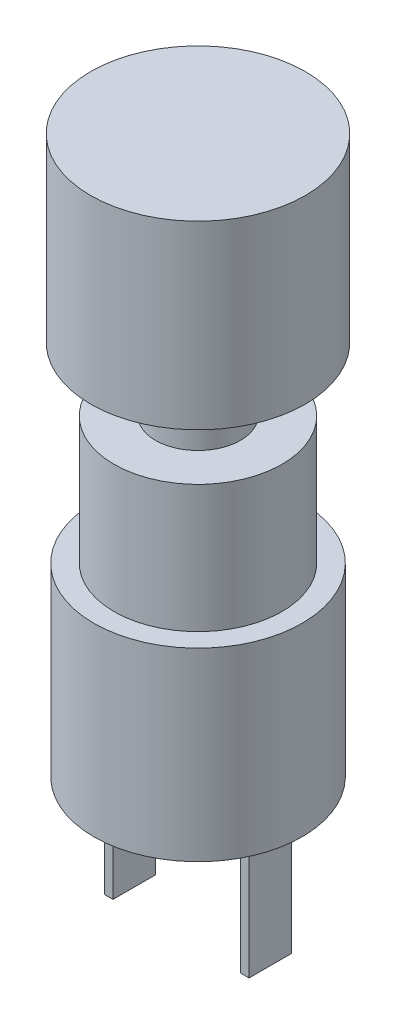
ISO-10303-21;
HEADER;
FILE_DESCRIPTION(('STEP AP214'),'2;1');
FILE_NAME('part.step','',(''),(''),'','','');
FILE_SCHEMA(('AUTOMOTIVE_DESIGN { 1 0 10303 214 1 1 1 1 }'));
ENDSEC;
DATA;
#1=APPLICATION_CONTEXT('core data for automotive mechanical design processes');
#2=APPLICATION_PROTOCOL_DEFINITION('international standard','automotive_design',2000,#1);
#3=PRODUCT_CONTEXT('',#1,'mechanical');
#4=PRODUCT('Part','Part','',(#3));
#5=PRODUCT_RELATED_PRODUCT_CATEGORY('part','',(#4));
#6=PRODUCT_DEFINITION_FORMATION('','',#4);
#7=PRODUCT_DEFINITION_CONTEXT('part definition',#1,'design');
#8=PRODUCT_DEFINITION('design','',#6,#7);
#9=PRODUCT_DEFINITION_SHAPE('','',#8);
#10=(LENGTH_UNIT() NAMED_UNIT(*) SI_UNIT(.MILLI.,.METRE.));
#11=(NAMED_UNIT(*) PLANE_ANGLE_UNIT() SI_UNIT($,.RADIAN.));
#12=(NAMED_UNIT(*) SI_UNIT($,.STERADIAN.) SOLID_ANGLE_UNIT());
#13=UNCERTAINTY_MEASURE_WITH_UNIT(LENGTH_MEASURE(1.E-05),#10,'distance_accuracy_value','');
#14=(GEOMETRIC_REPRESENTATION_CONTEXT(3) GLOBAL_UNCERTAINTY_ASSIGNED_CONTEXT((#13)) GLOBAL_UNIT_ASSIGNED_CONTEXT((#10,
#11,#12)) REPRESENTATION_CONTEXT('',''));
#15=CARTESIAN_POINT('',(0.,0.,0.));
#16=DIRECTION('',(0.,0.,1.));
#17=DIRECTION('',(1.,0.,0.));
#18=AXIS2_PLACEMENT_3D('',#15,#16,#17);
#19=CARTESIAN_POINT('',(0.,0.,0.));
#20=DIRECTION('',(0.,1.,0.));
#21=DIRECTION('',(0.,0.,1.));
#22=AXIS2_PLACEMENT_3D('',#19,#20,#21);
#23=PLANE('',#22);
#24=DIRECTION('',(0.,0.,1.));
#25=VECTOR('',#24,1.);
#26=CARTESIAN_POINT('',(-3.,0.,-1.));
#27=LINE('',#26,#25);
#28=CARTESIAN_POINT('',(-3.,0.,-1.));
#29=VERTEX_POINT('',#28);
#30=CARTESIAN_POINT('',(-3.,0.,0.999999999999999));
#31=VERTEX_POINT('',#30);
#32=EDGE_CURVE('E119',#29,#31,#27,.T.);
#33=ORIENTED_EDGE('',*,*,#32,.F.);
#34=DIRECTION('',(1.,0.,0.));
#35=VECTOR('',#34,1.);
#36=CARTESIAN_POINT('',(-3.,0.,-1.));
#37=LINE('',#36,#35);
#38=CARTESIAN_POINT('',(-3.4,0.,-1.));
#39=VERTEX_POINT('',#38);
#40=EDGE_CURVE('E132',#39,#29,#37,.T.);
#41=ORIENTED_EDGE('',*,*,#40,.F.);
#42=DIRECTION('',(0.,0.,-1.));
#43=VECTOR('',#42,1.);
#44=CARTESIAN_POINT('',(-3.4,0.,-1.));
#45=LINE('',#44,#43);
#46=CARTESIAN_POINT('',(-3.4,0.,0.999999999999999));
#47=VERTEX_POINT('',#46);
#48=EDGE_CURVE('E141',#47,#39,#45,.T.);
#49=ORIENTED_EDGE('',*,*,#48,.F.);
#50=DIRECTION('',(-1.,0.,0.));
#51=VECTOR('',#50,1.);
#52=CARTESIAN_POINT('',(-3.,0.,0.999999999999999));
#53=LINE('',#52,#51);
#54=EDGE_CURVE('E122',#31,#47,#53,.T.);
#55=ORIENTED_EDGE('',*,*,#54,.F.);
#56=EDGE_LOOP('',(#33,#41,#49,#55));
#57=FACE_BOUND('',#56,.T.);
#58=CARTESIAN_POINT('',(0.,0.,0.));
#59=DIRECTION('',(0.,1.,0.));
#60=DIRECTION('',(0.,0.,1.));
#61=AXIS2_PLACEMENT_3D('',#58,#59,#60);
#62=CIRCLE('',#61,4.9);
#63=CARTESIAN_POINT('',(0.,0.,4.9));
#64=VERTEX_POINT('',#63);
#65=EDGE_CURVE('E37',#64,#64,#62,.T.);
#66=ORIENTED_EDGE('',*,*,#65,.F.);
#67=EDGE_LOOP('',(#66));
#68=FACE_BOUND('',#67,.T.);
#69=DIRECTION('',(0.,0.,-1.));
#70=VECTOR('',#69,1.);
#71=CARTESIAN_POINT('',(3.,0.,-1.));
#72=LINE('',#71,#70);
#73=CARTESIAN_POINT('',(3.,0.,1.));
#74=VERTEX_POINT('',#73);
#75=CARTESIAN_POINT('',(3.,0.,-1.));
#76=VERTEX_POINT('',#75);
#77=EDGE_CURVE('E118',#74,#76,#72,.T.);
#78=ORIENTED_EDGE('',*,*,#77,.F.);
#79=DIRECTION('',(-1.,0.,0.));
#80=VECTOR('',#79,1.);
#81=CARTESIAN_POINT('',(3.,0.,1.));
#82=LINE('',#81,#80);
#83=CARTESIAN_POINT('',(3.4,0.,1.));
#84=VERTEX_POINT('',#83);
#85=EDGE_CURVE('E115',#84,#74,#82,.T.);
#86=ORIENTED_EDGE('',*,*,#85,.F.);
#87=DIRECTION('',(0.,0.,1.));
#88=VECTOR('',#87,1.);
#89=CARTESIAN_POINT('',(3.4,0.,-1.));
#90=LINE('',#89,#88);
#91=CARTESIAN_POINT('',(3.4,0.,-1.));
#92=VERTEX_POINT('',#91);
#93=EDGE_CURVE('E53',#92,#84,#90,.T.);
#94=ORIENTED_EDGE('',*,*,#93,.F.);
#95=DIRECTION('',(1.,0.,0.));
#96=VECTOR('',#95,1.);
#97=CARTESIAN_POINT('',(3.,0.,-1.));
#98=LINE('',#97,#96);
#99=EDGE_CURVE('E48',#76,#92,#98,.T.);
#100=ORIENTED_EDGE('',*,*,#99,.F.);
#101=EDGE_LOOP('',(#78,#86,#94,#100));
#102=FACE_BOUND('',#101,.T.);
#103=ADVANCED_FACE('F33',(#57,#68,#102),#23,.F.);
#104=CARTESIAN_POINT('',(0.,14.7,0.));
#105=DIRECTION('',(0.,1.,0.));
#106=DIRECTION('',(0.,0.,1.));
#107=AXIS2_PLACEMENT_3D('',#104,#105,#106);
#108=PLANE('',#107);
#109=CARTESIAN_POINT('',(0.,14.7,0.));
#110=DIRECTION('',(0.,1.,0.));
#111=DIRECTION('',(0.,0.,1.));
#112=AXIS2_PLACEMENT_3D('',#109,#110,#111);
#113=CIRCLE('',#112,3.95);
#114=CARTESIAN_POINT('',(0.,14.7,3.95));
#115=VERTEX_POINT('',#114);
#116=EDGE_CURVE('E170',#115,#115,#113,.T.);
#117=ORIENTED_EDGE('',*,*,#116,.T.);
#118=EDGE_LOOP('',(#117));
#119=FACE_BOUND('',#118,.T.);
#120=CARTESIAN_POINT('',(0.,14.7,0.));
#121=DIRECTION('',(0.,1.,0.));
#122=DIRECTION('',(0.,0.,1.));
#123=AXIS2_PLACEMENT_3D('',#120,#121,#122);
#124=CIRCLE('',#123,2.);
#125=CARTESIAN_POINT('',(0.,14.7,2.));
#126=VERTEX_POINT('',#125);
#127=EDGE_CURVE('E161',#126,#126,#124,.T.);
#128=ORIENTED_EDGE('',*,*,#127,.F.);
#129=EDGE_LOOP('',(#128));
#130=FACE_BOUND('',#129,.T.);
#131=ADVANCED_FACE('F180',(#119,#130),#108,.T.);
#132=CARTESIAN_POINT('',(0.,8.7,0.));
#133=DIRECTION('',(0.,1.,0.));
#134=DIRECTION('',(0.,0.,1.));
#135=AXIS2_PLACEMENT_3D('',#132,#133,#134);
#136=PLANE('',#135);
#137=CARTESIAN_POINT('',(0.,8.7,0.));
#138=DIRECTION('',(0.,1.,0.));
#139=DIRECTION('',(0.,0.,1.));
#140=AXIS2_PLACEMENT_3D('',#137,#138,#139);
#141=CIRCLE('',#140,4.9);
#142=CARTESIAN_POINT('',(0.,8.7,4.9));
#143=VERTEX_POINT('',#142);
#144=EDGE_CURVE('E11',#143,#143,#141,.T.);
#145=ORIENTED_EDGE('',*,*,#144,.T.);
#146=EDGE_LOOP('',(#145));
#147=FACE_BOUND('',#146,.T.);
#148=CARTESIAN_POINT('',(0.,8.7,0.));
#149=DIRECTION('',(0.,1.,0.));
#150=DIRECTION('',(0.,0.,1.));
#151=AXIS2_PLACEMENT_3D('',#148,#149,#150);
#152=CIRCLE('',#151,3.95);
#153=CARTESIAN_POINT('',(0.,8.7,3.95));
#154=VERTEX_POINT('',#153);
#155=EDGE_CURVE('E167',#154,#154,#152,.T.);
#156=ORIENTED_EDGE('',*,*,#155,.F.);
#157=EDGE_LOOP('',(#156));
#158=FACE_BOUND('',#157,.T.);
#159=ADVANCED_FACE('F178',(#147,#158),#136,.T.);
#160=CARTESIAN_POINT('',(0.,8.7,0.));
#161=DIRECTION('',(0.,-1.,0.));
#162=DIRECTION('',(0.,0.,-1.));
#163=AXIS2_PLACEMENT_3D('',#160,#161,#162);
#164=CYLINDRICAL_SURFACE('',#163,4.9);
#165=ORIENTED_EDGE('',*,*,#144,.F.);
#166=EDGE_LOOP('',(#165));
#167=FACE_BOUND('',#166,.T.);
#168=ORIENTED_EDGE('',*,*,#65,.T.);
#169=EDGE_LOOP('',(#168));
#170=FACE_BOUND('',#169,.T.);
#171=ADVANCED_FACE('F35',(#167,#170),#164,.T.);
#172=CARTESIAN_POINT('',(0.,14.7,0.));
#173=DIRECTION('',(0.,-1.,0.));
#174=DIRECTION('',(0.,0.,-1.));
#175=AXIS2_PLACEMENT_3D('',#172,#173,#174);
#176=CYLINDRICAL_SURFACE('',#175,3.95);
#177=ORIENTED_EDGE('',*,*,#116,.F.);
#178=EDGE_LOOP('',(#177));
#179=FACE_BOUND('',#178,.T.);
#180=ORIENTED_EDGE('',*,*,#155,.T.);
#181=EDGE_LOOP('',(#180));
#182=FACE_BOUND('',#181,.T.);
#183=ADVANCED_FACE('F176',(#179,#182),#176,.T.);
#184=CARTESIAN_POINT('',(0.,17.7,0.));
#185=DIRECTION('',(0.,-1.,0.));
#186=DIRECTION('',(0.,0.,-1.));
#187=AXIS2_PLACEMENT_3D('',#184,#185,#186);
#188=CYLINDRICAL_SURFACE('',#187,2.);
#189=CARTESIAN_POINT('',(0.,17.7,0.));
#190=DIRECTION('',(0.,1.,0.));
#191=DIRECTION('',(0.,0.,1.));
#192=AXIS2_PLACEMENT_3D('',#189,#190,#191);
#193=CIRCLE('',#192,2.);
#194=CARTESIAN_POINT('',(0.,17.7,2.));
#195=VERTEX_POINT('',#194);
#196=EDGE_CURVE('E164',#195,#195,#193,.T.);
#197=ORIENTED_EDGE('',*,*,#196,.F.);
#198=EDGE_LOOP('',(#197));
#199=FACE_BOUND('',#198,.T.);
#200=ORIENTED_EDGE('',*,*,#127,.T.);
#201=EDGE_LOOP('',(#200));
#202=FACE_BOUND('',#201,.T.);
#203=ADVANCED_FACE('F253',(#199,#202),#188,.T.);
#204=CARTESIAN_POINT('',(0.,17.7,0.));
#205=DIRECTION('',(0.,1.,0.));
#206=DIRECTION('',(0.,0.,1.));
#207=AXIS2_PLACEMENT_3D('',#204,#205,#206);
#208=PLANE('',#207);
#209=CARTESIAN_POINT('',(0.,17.7,0.));
#210=DIRECTION('',(0.,1.,0.));
#211=DIRECTION('',(0.,0.,1.));
#212=AXIS2_PLACEMENT_3D('',#209,#210,#211);
#213=CIRCLE('',#212,5.05);
#214=CARTESIAN_POINT('',(0.,17.7,5.05));
#215=VERTEX_POINT('',#214);
#216=EDGE_CURVE('E157',#215,#215,#213,.T.);
#217=ORIENTED_EDGE('',*,*,#216,.F.);
#218=EDGE_LOOP('',(#217));
#219=FACE_BOUND('',#218,.T.);
#220=ORIENTED_EDGE('',*,*,#196,.T.);
#221=EDGE_LOOP('',(#220));
#222=FACE_BOUND('',#221,.T.);
#223=ADVANCED_FACE('F250',(#219,#222),#208,.F.);
#224=CARTESIAN_POINT('',(0.,26.2,0.));
#225=DIRECTION('',(0.,-1.,0.));
#226=DIRECTION('',(0.,0.,-1.));
#227=AXIS2_PLACEMENT_3D('',#224,#225,#226);
#228=CYLINDRICAL_SURFACE('',#227,5.05);
#229=CARTESIAN_POINT('',(0.,26.2,0.));
#230=DIRECTION('',(0.,1.,0.));
#231=DIRECTION('',(0.,0.,1.));
#232=AXIS2_PLACEMENT_3D('',#229,#230,#231);
#233=CIRCLE('',#232,5.05);
#234=CARTESIAN_POINT('',(0.,26.2,5.05));
#235=VERTEX_POINT('',#234);
#236=EDGE_CURVE('E158',#235,#235,#233,.T.);
#237=ORIENTED_EDGE('',*,*,#236,.F.);
#238=EDGE_LOOP('',(#237));
#239=FACE_BOUND('',#238,.T.);
#240=ORIENTED_EDGE('',*,*,#216,.T.);
#241=EDGE_LOOP('',(#240));
#242=FACE_BOUND('',#241,.T.);
#243=ADVANCED_FACE('F248',(#239,#242),#228,.T.);
#244=CARTESIAN_POINT('',(0.,26.2,0.));
#245=DIRECTION('',(0.,1.,0.));
#246=DIRECTION('',(0.,0.,1.));
#247=AXIS2_PLACEMENT_3D('',#244,#245,#246);
#248=PLANE('',#247);
#249=ORIENTED_EDGE('',*,*,#236,.T.);
#250=EDGE_LOOP('',(#249));
#251=FACE_BOUND('',#250,.T.);
#252=ADVANCED_FACE('F244',(#251),#248,.T.);
#253=CARTESIAN_POINT('',(-3.,-6.,-1.));
#254=DIRECTION('',(-1.,0.,0.));
#255=DIRECTION('',(0.,0.,1.));
#256=AXIS2_PLACEMENT_3D('',#253,#254,#255);
#257=PLANE('',#256);
#258=ORIENTED_EDGE('',*,*,#32,.T.);
#259=DIRECTION('',(0.,1.,0.));
#260=VECTOR('',#259,1.);
#261=CARTESIAN_POINT('',(-3.,-6.,0.999999999999999));
#262=LINE('',#261,#260);
#263=CARTESIAN_POINT('',(-3.,-6.,0.999999999999999));
#264=VERTEX_POINT('',#263);
#265=EDGE_CURVE('E154',#264,#31,#262,.T.);
#266=ORIENTED_EDGE('',*,*,#265,.F.);
#267=DIRECTION('',(0.,0.,1.));
#268=VECTOR('',#267,1.);
#269=CARTESIAN_POINT('',(-3.,-6.,-1.));
#270=LINE('',#269,#268);
#271=CARTESIAN_POINT('',(-3.,-6.,-1.));
#272=VERTEX_POINT('',#271);
#273=EDGE_CURVE('E128',#272,#264,#270,.T.);
#274=ORIENTED_EDGE('',*,*,#273,.F.);
#275=DIRECTION('',(0.,1.,0.));
#276=VECTOR('',#275,1.);
#277=CARTESIAN_POINT('',(-3.,-6.,-1.));
#278=LINE('',#277,#276);
#279=EDGE_CURVE('E137',#272,#29,#278,.T.);
#280=ORIENTED_EDGE('',*,*,#279,.T.);
#281=EDGE_LOOP('',(#258,#266,#274,#280));
#282=FACE_BOUND('',#281,.T.);
#283=ADVANCED_FACE('F240',(#282),#257,.F.);
#284=CARTESIAN_POINT('',(-3.,-6.,0.999999999999999));
#285=DIRECTION('',(0.,0.,-1.));
#286=DIRECTION('',(-1.,0.,0.));
#287=AXIS2_PLACEMENT_3D('',#284,#285,#286);
#288=PLANE('',#287);
#289=ORIENTED_EDGE('',*,*,#54,.T.);
#290=DIRECTION('',(0.,1.,0.));
#291=VECTOR('',#290,1.);
#292=CARTESIAN_POINT('',(-3.4,-6.,0.999999999999999));
#293=LINE('',#292,#291);
#294=CARTESIAN_POINT('',(-3.4,-6.,0.999999999999999));
#295=VERTEX_POINT('',#294);
#296=EDGE_CURVE('E151',#295,#47,#293,.T.);
#297=ORIENTED_EDGE('',*,*,#296,.F.);
#298=DIRECTION('',(-1.,0.,0.));
#299=VECTOR('',#298,1.);
#300=CARTESIAN_POINT('',(-3.,-6.,0.999999999999999));
#301=LINE('',#300,#299);
#302=EDGE_CURVE('E131',#264,#295,#301,.T.);
#303=ORIENTED_EDGE('',*,*,#302,.F.);
#304=ORIENTED_EDGE('',*,*,#265,.T.);
#305=EDGE_LOOP('',(#289,#297,#303,#304));
#306=FACE_BOUND('',#305,.T.);
#307=ADVANCED_FACE('F236',(#306),#288,.F.);
#308=CARTESIAN_POINT('',(-3.4,-6.,-1.));
#309=DIRECTION('',(1.,0.,0.));
#310=DIRECTION('',(0.,0.,-1.));
#311=AXIS2_PLACEMENT_3D('',#308,#309,#310);
#312=PLANE('',#311);
#313=ORIENTED_EDGE('',*,*,#48,.T.);
#314=DIRECTION('',(0.,1.,0.));
#315=VECTOR('',#314,1.);
#316=CARTESIAN_POINT('',(-3.4,-6.,-1.));
#317=LINE('',#316,#315);
#318=CARTESIAN_POINT('',(-3.4,-6.,-1.));
#319=VERTEX_POINT('',#318);
#320=EDGE_CURVE('E148',#319,#39,#317,.T.);
#321=ORIENTED_EDGE('',*,*,#320,.F.);
#322=DIRECTION('',(0.,0.,-1.));
#323=VECTOR('',#322,1.);
#324=CARTESIAN_POINT('',(-3.4,-6.,-1.));
#325=LINE('',#324,#323);
#326=EDGE_CURVE('E134',#295,#319,#325,.T.);
#327=ORIENTED_EDGE('',*,*,#326,.F.);
#328=ORIENTED_EDGE('',*,*,#296,.T.);
#329=EDGE_LOOP('',(#313,#321,#327,#328));
#330=FACE_BOUND('',#329,.T.);
#331=ADVANCED_FACE('F232',(#330),#312,.F.);
#332=CARTESIAN_POINT('',(-3.,-6.,-1.));
#333=DIRECTION('',(0.,0.,1.));
#334=DIRECTION('',(1.,0.,0.));
#335=AXIS2_PLACEMENT_3D('',#332,#333,#334);
#336=PLANE('',#335);
#337=ORIENTED_EDGE('',*,*,#40,.T.);
#338=ORIENTED_EDGE('',*,*,#279,.F.);
#339=DIRECTION('',(1.,0.,0.));
#340=VECTOR('',#339,1.);
#341=CARTESIAN_POINT('',(-3.,-6.,-1.));
#342=LINE('',#341,#340);
#343=EDGE_CURVE('E136',#319,#272,#342,.T.);
#344=ORIENTED_EDGE('',*,*,#343,.F.);
#345=ORIENTED_EDGE('',*,*,#320,.T.);
#346=EDGE_LOOP('',(#337,#338,#344,#345));
#347=FACE_BOUND('',#346,.T.);
#348=ADVANCED_FACE('F228',(#347),#336,.F.);
#349=CARTESIAN_POINT('',(0.,-6.,0.));
#350=DIRECTION('',(0.,-1.,0.));
#351=DIRECTION('',(0.,0.,-1.));
#352=AXIS2_PLACEMENT_3D('',#349,#350,#351);
#353=PLANE('',#352);
#354=ORIENTED_EDGE('',*,*,#273,.T.);
#355=ORIENTED_EDGE('',*,*,#302,.T.);
#356=ORIENTED_EDGE('',*,*,#326,.T.);
#357=ORIENTED_EDGE('',*,*,#343,.T.);
#358=EDGE_LOOP('',(#354,#355,#356,#357));
#359=FACE_BOUND('',#358,.T.);
#360=ADVANCED_FACE('F225',(#359),#353,.T.);
#361=CARTESIAN_POINT('',(3.,-6.,-1.));
#362=DIRECTION('',(1.,0.,0.));
#363=DIRECTION('',(0.,0.,-1.));
#364=AXIS2_PLACEMENT_3D('',#361,#362,#363);
#365=PLANE('',#364);
#366=ORIENTED_EDGE('',*,*,#77,.T.);
#367=DIRECTION('',(0.,1.,0.));
#368=VECTOR('',#367,1.);
#369=CARTESIAN_POINT('',(3.,-6.,-1.));
#370=LINE('',#369,#368);
#371=CARTESIAN_POINT('',(3.,-6.,-1.));
#372=VERTEX_POINT('',#371);
#373=EDGE_CURVE('E99',#372,#76,#370,.T.);
#374=ORIENTED_EDGE('',*,*,#373,.F.);
#375=DIRECTION('',(0.,0.,-1.));
#376=VECTOR('',#375,1.);
#377=CARTESIAN_POINT('',(3.,-6.,-1.));
#378=LINE('',#377,#376);
#379=CARTESIAN_POINT('',(3.,-6.,1.));
#380=VERTEX_POINT('',#379);
#381=EDGE_CURVE('E106',#380,#372,#378,.T.);
#382=ORIENTED_EDGE('',*,*,#381,.F.);
#383=DIRECTION('',(0.,1.,0.));
#384=VECTOR('',#383,1.);
#385=CARTESIAN_POINT('',(3.,-6.,1.));
#386=LINE('',#385,#384);
#387=EDGE_CURVE('E203',#380,#74,#386,.T.);
#388=ORIENTED_EDGE('',*,*,#387,.T.);
#389=EDGE_LOOP('',(#366,#374,#382,#388));
#390=FACE_BOUND('',#389,.T.);
#391=ADVANCED_FACE('F117',(#390),#365,.F.);
#392=CARTESIAN_POINT('',(3.,-6.,-1.));
#393=DIRECTION('',(0.,0.,1.));
#394=DIRECTION('',(1.,0.,0.));
#395=AXIS2_PLACEMENT_3D('',#392,#393,#394);
#396=PLANE('',#395);
#397=ORIENTED_EDGE('',*,*,#99,.T.);
#398=DIRECTION('',(0.,1.,0.));
#399=VECTOR('',#398,1.);
#400=CARTESIAN_POINT('',(3.4,-6.,-1.));
#401=LINE('',#400,#399);
#402=CARTESIAN_POINT('',(3.4,-6.,-1.));
#403=VERTEX_POINT('',#402);
#404=EDGE_CURVE('E102',#403,#92,#401,.T.);
#405=ORIENTED_EDGE('',*,*,#404,.F.);
#406=DIRECTION('',(1.,0.,0.));
#407=VECTOR('',#406,1.);
#408=CARTESIAN_POINT('',(3.,-6.,-1.));
#409=LINE('',#408,#407);
#410=EDGE_CURVE('E95',#372,#403,#409,.T.);
#411=ORIENTED_EDGE('',*,*,#410,.F.);
#412=ORIENTED_EDGE('',*,*,#373,.T.);
#413=EDGE_LOOP('',(#397,#405,#411,#412));
#414=FACE_BOUND('',#413,.T.);
#415=ADVANCED_FACE('F97',(#414),#396,.F.);
#416=CARTESIAN_POINT('',(3.4,-6.,-1.));
#417=DIRECTION('',(-1.,0.,0.));
#418=DIRECTION('',(0.,0.,1.));
#419=AXIS2_PLACEMENT_3D('',#416,#417,#418);
#420=PLANE('',#419);
#421=ORIENTED_EDGE('',*,*,#93,.T.);
#422=DIRECTION('',(0.,1.,0.));
#423=VECTOR('',#422,1.);
#424=CARTESIAN_POINT('',(3.4,-6.,1.));
#425=LINE('',#424,#423);
#426=CARTESIAN_POINT('',(3.4,-6.,1.));
#427=VERTEX_POINT('',#426);
#428=EDGE_CURVE('E124',#427,#84,#425,.T.);
#429=ORIENTED_EDGE('',*,*,#428,.F.);
#430=DIRECTION('',(0.,0.,1.));
#431=VECTOR('',#430,1.);
#432=CARTESIAN_POINT('',(3.4,-6.,-1.));
#433=LINE('',#432,#431);
#434=EDGE_CURVE('E105',#403,#427,#433,.T.);
#435=ORIENTED_EDGE('',*,*,#434,.F.);
#436=ORIENTED_EDGE('',*,*,#404,.T.);
#437=EDGE_LOOP('',(#421,#429,#435,#436));
#438=FACE_BOUND('',#437,.T.);
#439=ADVANCED_FACE('F212',(#438),#420,.F.);
#440=CARTESIAN_POINT('',(3.,-6.,1.));
#441=DIRECTION('',(0.,0.,-1.));
#442=DIRECTION('',(-1.,0.,0.));
#443=AXIS2_PLACEMENT_3D('',#440,#441,#442);
#444=PLANE('',#443);
#445=ORIENTED_EDGE('',*,*,#85,.T.);
#446=ORIENTED_EDGE('',*,*,#387,.F.);
#447=DIRECTION('',(-1.,0.,0.));
#448=VECTOR('',#447,1.);
#449=CARTESIAN_POINT('',(3.,-6.,1.));
#450=LINE('',#449,#448);
#451=EDGE_CURVE('E111',#427,#380,#450,.T.);
#452=ORIENTED_EDGE('',*,*,#451,.F.);
#453=ORIENTED_EDGE('',*,*,#428,.T.);
#454=EDGE_LOOP('',(#445,#446,#452,#453));
#455=FACE_BOUND('',#454,.T.);
#456=ADVANCED_FACE('F202',(#455),#444,.F.);
#457=CARTESIAN_POINT('',(0.,-6.,0.));
#458=DIRECTION('',(0.,1.,0.));
#459=DIRECTION('',(0.,0.,1.));
#460=AXIS2_PLACEMENT_3D('',#457,#458,#459);
#461=PLANE('',#460);
#462=ORIENTED_EDGE('',*,*,#381,.T.);
#463=ORIENTED_EDGE('',*,*,#410,.T.);
#464=ORIENTED_EDGE('',*,*,#434,.T.);
#465=ORIENTED_EDGE('',*,*,#451,.T.);
#466=EDGE_LOOP('',(#462,#463,#464,#465));
#467=FACE_BOUND('',#466,.T.);
#468=ADVANCED_FACE('F109',(#467),#461,.F.);
#469=CLOSED_SHELL('',(#103,#131,#159,#171,#183,#203,#223,#243,#252,#283,#307,#331,#348,#360,
#391,#415,#439,#456,#468));
#470=MANIFOLD_SOLID_BREP('B2',#469);
#471=ADVANCED_BREP_SHAPE_REPRESENTATION('',(#18,#470),#14);
#472=SHAPE_DEFINITION_REPRESENTATION(#9,#471);
ENDSEC;
END-ISO-10303-21;
